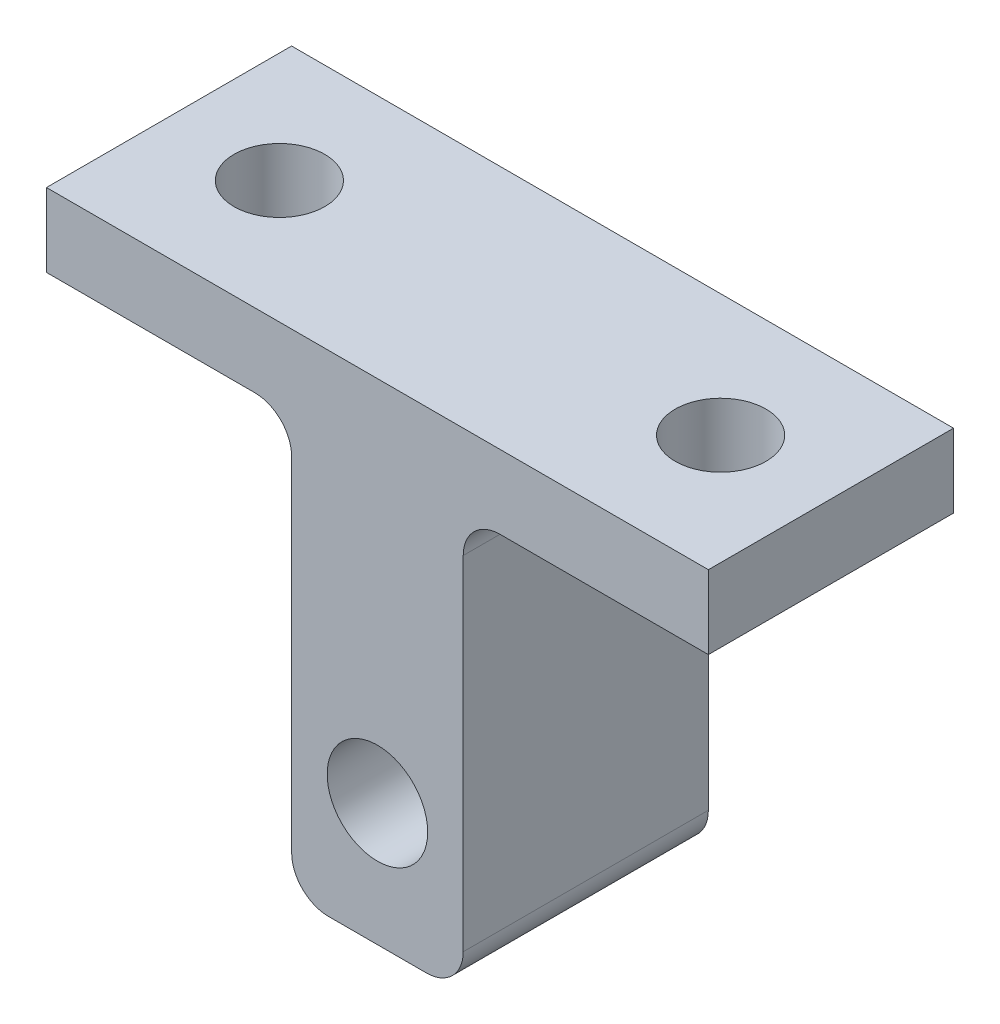
ISO-10303-21;
HEADER;
FILE_DESCRIPTION(('STEP AP214'),'2;1');
FILE_NAME('part.step','',(''),(''),'','','');
FILE_SCHEMA(('AUTOMOTIVE_DESIGN { 1 0 10303 214 1 1 1 1 }'));
ENDSEC;
DATA;
#1=APPLICATION_CONTEXT('core data for automotive mechanical design processes');
#2=APPLICATION_PROTOCOL_DEFINITION('international standard','automotive_design',2000,#1);
#3=PRODUCT_CONTEXT('',#1,'mechanical');
#4=PRODUCT('Part','Part','',(#3));
#5=PRODUCT_RELATED_PRODUCT_CATEGORY('part','',(#4));
#6=PRODUCT_DEFINITION_FORMATION('','',#4);
#7=PRODUCT_DEFINITION_CONTEXT('part definition',#1,'design');
#8=PRODUCT_DEFINITION('design','',#6,#7);
#9=PRODUCT_DEFINITION_SHAPE('','',#8);
#10=(LENGTH_UNIT() NAMED_UNIT(*) SI_UNIT(.MILLI.,.METRE.));
#11=(NAMED_UNIT(*) PLANE_ANGLE_UNIT() SI_UNIT($,.RADIAN.));
#12=(NAMED_UNIT(*) SI_UNIT($,.STERADIAN.) SOLID_ANGLE_UNIT());
#13=UNCERTAINTY_MEASURE_WITH_UNIT(LENGTH_MEASURE(1.E-05),#10,'distance_accuracy_value','');
#14=(GEOMETRIC_REPRESENTATION_CONTEXT(3) GLOBAL_UNCERTAINTY_ASSIGNED_CONTEXT((#13)) GLOBAL_UNIT_ASSIGNED_CONTEXT((#10,
#11,#12)) REPRESENTATION_CONTEXT('',''));
#15=CARTESIAN_POINT('',(0.,0.,0.));
#16=DIRECTION('',(0.,0.,1.));
#17=DIRECTION('',(1.,0.,0.));
#18=AXIS2_PLACEMENT_3D('',#15,#16,#17);
#19=CARTESIAN_POINT('',(0.,0.,5.));
#20=DIRECTION('',(0.,0.,-1.));
#21=DIRECTION('',(-1.,0.,0.));
#22=AXIS2_PLACEMENT_3D('',#19,#20,#21);
#23=PLANE('',#22);
#24=DIRECTION('',(0.,-1.,0.));
#25=VECTOR('',#24,1.);
#26=CARTESIAN_POINT('',(-3.5,0.,5.));
#27=LINE('',#26,#25);
#28=CARTESIAN_POINT('',(-3.5,-1.5,5.));
#29=VERTEX_POINT('',#28);
#30=CARTESIAN_POINT('',(-3.5,-15.5,5.));
#31=VERTEX_POINT('',#30);
#32=EDGE_CURVE('E130',#29,#31,#27,.T.);
#33=ORIENTED_EDGE('',*,*,#32,.T.);
#34=CARTESIAN_POINT('',(-2.,-15.5,5.));
#35=DIRECTION('',(0.,0.,-1.));
#36=DIRECTION('',(-1.,0.,0.));
#37=AXIS2_PLACEMENT_3D('',#34,#35,#36);
#38=CIRCLE('',#37,1.5);
#39=CARTESIAN_POINT('',(-2.,-17.,5.));
#40=VERTEX_POINT('',#39);
#41=EDGE_CURVE('E175',#31,#40,#38,.F.);
#42=ORIENTED_EDGE('',*,*,#41,.T.);
#43=DIRECTION('',(1.,0.,0.));
#44=VECTOR('',#43,1.);
#45=CARTESIAN_POINT('',(-3.5,-17.,5.));
#46=LINE('',#45,#44);
#47=CARTESIAN_POINT('',(2.,-17.,5.));
#48=VERTEX_POINT('',#47);
#49=EDGE_CURVE('E193',#40,#48,#46,.T.);
#50=ORIENTED_EDGE('',*,*,#49,.T.);
#51=CARTESIAN_POINT('',(2.,-15.5,5.));
#52=DIRECTION('',(0.,0.,-1.));
#53=DIRECTION('',(-1.,0.,0.));
#54=AXIS2_PLACEMENT_3D('',#51,#52,#53);
#55=CIRCLE('',#54,1.5);
#56=CARTESIAN_POINT('',(3.5,-15.5,5.));
#57=VERTEX_POINT('',#56);
#58=EDGE_CURVE('E173',#48,#57,#55,.F.);
#59=ORIENTED_EDGE('',*,*,#58,.T.);
#60=DIRECTION('',(0.,1.,0.));
#61=VECTOR('',#60,1.);
#62=CARTESIAN_POINT('',(3.5,-17.,5.));
#63=LINE('',#62,#61);
#64=CARTESIAN_POINT('',(3.5,-1.5,5.));
#65=VERTEX_POINT('',#64);
#66=EDGE_CURVE('E196',#57,#65,#63,.T.);
#67=ORIENTED_EDGE('',*,*,#66,.T.);
#68=CARTESIAN_POINT('',(5.,-1.5,5.));
#69=DIRECTION('',(0.,0.,-1.));
#70=DIRECTION('',(-1.,0.,0.));
#71=AXIS2_PLACEMENT_3D('',#68,#69,#70);
#72=CIRCLE('',#71,1.5);
#73=CARTESIAN_POINT('',(5.,0.,5.));
#74=VERTEX_POINT('',#73);
#75=EDGE_CURVE('E180',#65,#74,#72,.T.);
#76=ORIENTED_EDGE('',*,*,#75,.T.);
#77=DIRECTION('',(1.,0.,0.));
#78=VECTOR('',#77,1.);
#79=CARTESIAN_POINT('',(3.5,0.,5.));
#80=LINE('',#79,#78);
#81=CARTESIAN_POINT('',(13.5023923444976,0.,5.));
#82=VERTEX_POINT('',#81);
#83=EDGE_CURVE('E201',#74,#82,#80,.T.);
#84=ORIENTED_EDGE('',*,*,#83,.T.);
#85=DIRECTION('',(0.,1.,0.));
#86=VECTOR('',#85,1.);
#87=CARTESIAN_POINT('',(13.5023923444976,3.,5.));
#88=LINE('',#87,#86);
#89=CARTESIAN_POINT('',(13.5023923444976,3.,5.));
#90=VERTEX_POINT('',#89);
#91=EDGE_CURVE('E203',#82,#90,#88,.T.);
#92=ORIENTED_EDGE('',*,*,#91,.T.);
#93=DIRECTION('',(-1.,0.,0.));
#94=VECTOR('',#93,1.);
#95=CARTESIAN_POINT('',(-13.5023923444976,3.,5.));
#96=LINE('',#95,#94);
#97=CARTESIAN_POINT('',(-13.5023923444976,3.,5.));
#98=VERTEX_POINT('',#97);
#99=EDGE_CURVE('E136',#90,#98,#96,.T.);
#100=ORIENTED_EDGE('',*,*,#99,.T.);
#101=DIRECTION('',(0.,-1.,0.));
#102=VECTOR('',#101,1.);
#103=CARTESIAN_POINT('',(-13.5023923444976,0.,5.));
#104=LINE('',#103,#102);
#105=CARTESIAN_POINT('',(-13.5023923444976,0.,5.));
#106=VERTEX_POINT('',#105);
#107=EDGE_CURVE('E131',#98,#106,#104,.T.);
#108=ORIENTED_EDGE('',*,*,#107,.T.);
#109=DIRECTION('',(1.,0.,0.));
#110=VECTOR('',#109,1.);
#111=CARTESIAN_POINT('',(-13.5023923444976,0.,5.));
#112=LINE('',#111,#110);
#113=CARTESIAN_POINT('',(-5.,0.,5.));
#114=VERTEX_POINT('',#113);
#115=EDGE_CURVE('E122',#106,#114,#112,.T.);
#116=ORIENTED_EDGE('',*,*,#115,.T.);
#117=CARTESIAN_POINT('',(-5.,-1.5,5.));
#118=DIRECTION('',(0.,0.,-1.));
#119=DIRECTION('',(-1.,0.,0.));
#120=AXIS2_PLACEMENT_3D('',#117,#118,#119);
#121=CIRCLE('',#120,1.5);
#122=EDGE_CURVE('E11',#114,#29,#121,.T.);
#123=ORIENTED_EDGE('',*,*,#122,.T.);
#124=EDGE_LOOP('',(#33,#42,#50,#59,#67,#76,#84,#92,#100,#108,#116,#123));
#125=FACE_BOUND('',#124,.T.);
#126=CARTESIAN_POINT('',(0.,-12.,5.));
#127=DIRECTION('',(0.,0.,1.));
#128=DIRECTION('',(1.,0.,0.));
#129=AXIS2_PLACEMENT_3D('',#126,#127,#128);
#130=CIRCLE('',#129,2.05);
#131=CARTESIAN_POINT('',(2.05,-12.,5.));
#132=VERTEX_POINT('',#131);
#133=EDGE_CURVE('E207',#132,#132,#130,.T.);
#134=ORIENTED_EDGE('',*,*,#133,.F.);
#135=EDGE_LOOP('',(#134));
#136=FACE_BOUND('',#135,.T.);
#137=ADVANCED_FACE('F33',(#125,#136),#23,.F.);
#138=CARTESIAN_POINT('',(0.,0.,-5.));
#139=DIRECTION('',(0.,0.,-1.));
#140=DIRECTION('',(-1.,0.,0.));
#141=AXIS2_PLACEMENT_3D('',#138,#139,#140);
#142=PLANE('',#141);
#143=DIRECTION('',(1.,0.,0.));
#144=VECTOR('',#143,1.);
#145=CARTESIAN_POINT('',(-3.5,-17.,-5.));
#146=LINE('',#145,#144);
#147=CARTESIAN_POINT('',(-2.,-17.,-5.));
#148=VERTEX_POINT('',#147);
#149=CARTESIAN_POINT('',(2.,-17.,-5.));
#150=VERTEX_POINT('',#149);
#151=EDGE_CURVE('E210',#148,#150,#146,.T.);
#152=ORIENTED_EDGE('',*,*,#151,.F.);
#153=CARTESIAN_POINT('',(-2.,-15.5,-5.));
#154=DIRECTION('',(0.,0.,-1.));
#155=DIRECTION('',(-1.,0.,0.));
#156=AXIS2_PLACEMENT_3D('',#153,#154,#155);
#157=CIRCLE('',#156,1.5);
#158=CARTESIAN_POINT('',(-3.5,-15.5,-5.));
#159=VERTEX_POINT('',#158);
#160=EDGE_CURVE('E167',#148,#159,#157,.T.);
#161=ORIENTED_EDGE('',*,*,#160,.T.);
#162=DIRECTION('',(0.,-1.,0.));
#163=VECTOR('',#162,1.);
#164=CARTESIAN_POINT('',(-3.5,0.,-5.));
#165=LINE('',#164,#163);
#166=CARTESIAN_POINT('',(-3.5,-1.5,-5.));
#167=VERTEX_POINT('',#166);
#168=EDGE_CURVE('E187',#167,#159,#165,.T.);
#169=ORIENTED_EDGE('',*,*,#168,.F.);
#170=CARTESIAN_POINT('',(-5.,-1.5,-5.));
#171=DIRECTION('',(0.,0.,-1.));
#172=DIRECTION('',(-1.,0.,0.));
#173=AXIS2_PLACEMENT_3D('',#170,#171,#172);
#174=CIRCLE('',#173,1.5);
#175=CARTESIAN_POINT('',(-5.,0.,-5.));
#176=VERTEX_POINT('',#175);
#177=EDGE_CURVE('E41',#167,#176,#174,.F.);
#178=ORIENTED_EDGE('',*,*,#177,.T.);
#179=DIRECTION('',(1.,0.,0.));
#180=VECTOR('',#179,1.);
#181=CARTESIAN_POINT('',(-13.5023923444976,0.,-5.));
#182=LINE('',#181,#180);
#183=CARTESIAN_POINT('',(-13.5023923444976,0.,-5.));
#184=VERTEX_POINT('',#183);
#185=EDGE_CURVE('E186',#184,#176,#182,.T.);
#186=ORIENTED_EDGE('',*,*,#185,.F.);
#187=DIRECTION('',(0.,-1.,0.));
#188=VECTOR('',#187,1.);
#189=CARTESIAN_POINT('',(-13.5023923444976,0.,-5.));
#190=LINE('',#189,#188);
#191=CARTESIAN_POINT('',(-13.5023923444976,3.,-5.));
#192=VERTEX_POINT('',#191);
#193=EDGE_CURVE('E144',#192,#184,#190,.T.);
#194=ORIENTED_EDGE('',*,*,#193,.F.);
#195=DIRECTION('',(-1.,0.,0.));
#196=VECTOR('',#195,1.);
#197=CARTESIAN_POINT('',(-13.5023923444976,3.,-5.));
#198=LINE('',#197,#196);
#199=CARTESIAN_POINT('',(13.5023923444976,3.,-5.));
#200=VERTEX_POINT('',#199);
#201=EDGE_CURVE('E140',#200,#192,#198,.T.);
#202=ORIENTED_EDGE('',*,*,#201,.F.);
#203=DIRECTION('',(0.,1.,0.));
#204=VECTOR('',#203,1.);
#205=CARTESIAN_POINT('',(13.5023923444976,3.,-5.));
#206=LINE('',#205,#204);
#207=CARTESIAN_POINT('',(13.5023923444976,0.,-5.));
#208=VERTEX_POINT('',#207);
#209=EDGE_CURVE('E218',#208,#200,#206,.T.);
#210=ORIENTED_EDGE('',*,*,#209,.F.);
#211=DIRECTION('',(1.,0.,0.));
#212=VECTOR('',#211,1.);
#213=CARTESIAN_POINT('',(3.5,0.,-5.));
#214=LINE('',#213,#212);
#215=CARTESIAN_POINT('',(5.,0.,-5.));
#216=VERTEX_POINT('',#215);
#217=EDGE_CURVE('E216',#216,#208,#214,.T.);
#218=ORIENTED_EDGE('',*,*,#217,.F.);
#219=CARTESIAN_POINT('',(5.,-1.5,-5.));
#220=DIRECTION('',(0.,0.,-1.));
#221=DIRECTION('',(-1.,0.,0.));
#222=AXIS2_PLACEMENT_3D('',#219,#220,#221);
#223=CIRCLE('',#222,1.5);
#224=CARTESIAN_POINT('',(3.5,-1.5,-5.));
#225=VERTEX_POINT('',#224);
#226=EDGE_CURVE('E178',#216,#225,#223,.F.);
#227=ORIENTED_EDGE('',*,*,#226,.T.);
#228=DIRECTION('',(0.,1.,0.));
#229=VECTOR('',#228,1.);
#230=CARTESIAN_POINT('',(3.5,-17.,-5.));
#231=LINE('',#230,#229);
#232=CARTESIAN_POINT('',(3.5,-15.5,-5.));
#233=VERTEX_POINT('',#232);
#234=EDGE_CURVE('E213',#233,#225,#231,.T.);
#235=ORIENTED_EDGE('',*,*,#234,.F.);
#236=CARTESIAN_POINT('',(2.,-15.5,-5.));
#237=DIRECTION('',(0.,0.,-1.));
#238=DIRECTION('',(-1.,0.,0.));
#239=AXIS2_PLACEMENT_3D('',#236,#237,#238);
#240=CIRCLE('',#239,1.5);
#241=EDGE_CURVE('E165',#233,#150,#240,.T.);
#242=ORIENTED_EDGE('',*,*,#241,.T.);
#243=EDGE_LOOP('',(#152,#161,#169,#178,#186,#194,#202,#210,#218,#227,#235,#242));
#244=FACE_BOUND('',#243,.T.);
#245=CARTESIAN_POINT('',(0.,-12.,-5.));
#246=DIRECTION('',(0.,0.,1.));
#247=DIRECTION('',(1.,0.,0.));
#248=AXIS2_PLACEMENT_3D('',#245,#246,#247);
#249=CIRCLE('',#248,2.05);
#250=CARTESIAN_POINT('',(2.05,-12.,-5.));
#251=VERTEX_POINT('',#250);
#252=EDGE_CURVE('E388',#251,#251,#249,.T.);
#253=ORIENTED_EDGE('',*,*,#252,.T.);
#254=EDGE_LOOP('',(#253));
#255=FACE_BOUND('',#254,.T.);
#256=ADVANCED_FACE('F184',(#244,#255),#142,.T.);
#257=CARTESIAN_POINT('',(-13.5023923444976,0.,5.));
#258=DIRECTION('',(1.,0.,0.));
#259=DIRECTION('',(0.,0.,-1.));
#260=AXIS2_PLACEMENT_3D('',#257,#258,#259);
#261=PLANE('',#260);
#262=ORIENTED_EDGE('',*,*,#193,.T.);
#263=DIRECTION('',(0.,0.,-1.));
#264=VECTOR('',#263,1.);
#265=CARTESIAN_POINT('',(-13.5023923444976,0.,5.));
#266=LINE('',#265,#264);
#267=EDGE_CURVE('E126',#106,#184,#266,.T.);
#268=ORIENTED_EDGE('',*,*,#267,.F.);
#269=ORIENTED_EDGE('',*,*,#107,.F.);
#270=DIRECTION('',(0.,0.,-1.));
#271=VECTOR('',#270,1.);
#272=CARTESIAN_POINT('',(-13.5023923444976,3.,5.));
#273=LINE('',#272,#271);
#274=EDGE_CURVE('E206',#98,#192,#273,.T.);
#275=ORIENTED_EDGE('',*,*,#274,.T.);
#276=EDGE_LOOP('',(#262,#268,#269,#275));
#277=FACE_BOUND('',#276,.T.);
#278=ADVANCED_FACE('F142',(#277),#261,.F.);
#279=CARTESIAN_POINT('',(-13.5023923444976,0.,5.));
#280=DIRECTION('',(0.,1.,0.));
#281=DIRECTION('',(0.,0.,1.));
#282=AXIS2_PLACEMENT_3D('',#279,#280,#281);
#283=PLANE('',#282);
#284=CARTESIAN_POINT('',(-9.,0.,0.));
#285=DIRECTION('',(0.,1.,0.));
#286=DIRECTION('',(0.,0.,1.));
#287=AXIS2_PLACEMENT_3D('',#284,#285,#286);
#288=CIRCLE('',#287,1.85);
#289=CARTESIAN_POINT('',(-9.,0.,1.85));
#290=VERTEX_POINT('',#289);
#291=EDGE_CURVE('E382',#290,#290,#288,.T.);
#292=ORIENTED_EDGE('',*,*,#291,.T.);
#293=EDGE_LOOP('',(#292));
#294=FACE_BOUND('',#293,.T.);
#295=ORIENTED_EDGE('',*,*,#185,.T.);
#296=DIRECTION('',(0.,0.,-1.));
#297=VECTOR('',#296,1.);
#298=CARTESIAN_POINT('',(-5.,0.,5.));
#299=LINE('',#298,#297);
#300=EDGE_CURVE('E48',#176,#114,#299,.F.);
#301=ORIENTED_EDGE('',*,*,#300,.T.);
#302=ORIENTED_EDGE('',*,*,#115,.F.);
#303=ORIENTED_EDGE('',*,*,#267,.T.);
#304=EDGE_LOOP('',(#295,#301,#302,#303));
#305=FACE_BOUND('',#304,.T.);
#306=ADVANCED_FACE('F124',(#294,#305),#283,.F.);
#307=CARTESIAN_POINT('',(-3.5,0.,5.));
#308=DIRECTION('',(1.,0.,0.));
#309=DIRECTION('',(0.,1.,0.));
#310=AXIS2_PLACEMENT_3D('',#307,#308,#309);
#311=PLANE('',#310);
#312=ORIENTED_EDGE('',*,*,#168,.T.);
#313=DIRECTION('',(0.,0.,-1.));
#314=VECTOR('',#313,1.);
#315=CARTESIAN_POINT('',(-3.5,-15.5,5.));
#316=LINE('',#315,#314);
#317=EDGE_CURVE('E56',#159,#31,#316,.F.);
#318=ORIENTED_EDGE('',*,*,#317,.T.);
#319=ORIENTED_EDGE('',*,*,#32,.F.);
#320=DIRECTION('',(0.,0.,-1.));
#321=VECTOR('',#320,1.);
#322=CARTESIAN_POINT('',(-3.5,-1.5,-5.));
#323=LINE('',#322,#321);
#324=EDGE_CURVE('E169',#29,#167,#323,.T.);
#325=ORIENTED_EDGE('',*,*,#324,.T.);
#326=EDGE_LOOP('',(#312,#318,#319,#325));
#327=FACE_BOUND('',#326,.T.);
#328=ADVANCED_FACE('F192',(#327),#311,.F.);
#329=CARTESIAN_POINT('',(-3.5,-17.,5.));
#330=DIRECTION('',(0.,1.,0.));
#331=DIRECTION('',(0.,0.,1.));
#332=AXIS2_PLACEMENT_3D('',#329,#330,#331);
#333=PLANE('',#332);
#334=ORIENTED_EDGE('',*,*,#49,.F.);
#335=DIRECTION('',(0.,0.,-1.));
#336=VECTOR('',#335,1.);
#337=CARTESIAN_POINT('',(-2.,-17.,5.));
#338=LINE('',#337,#336);
#339=EDGE_CURVE('E162',#40,#148,#338,.T.);
#340=ORIENTED_EDGE('',*,*,#339,.T.);
#341=ORIENTED_EDGE('',*,*,#151,.T.);
#342=DIRECTION('',(0.,0.,-1.));
#343=VECTOR('',#342,1.);
#344=CARTESIAN_POINT('',(2.,-17.,5.));
#345=LINE('',#344,#343);
#346=EDGE_CURVE('E160',#150,#48,#345,.F.);
#347=ORIENTED_EDGE('',*,*,#346,.T.);
#348=EDGE_LOOP('',(#334,#340,#341,#347));
#349=FACE_BOUND('',#348,.T.);
#350=ADVANCED_FACE('F251',(#349),#333,.F.);
#351=CARTESIAN_POINT('',(3.5,-17.,5.));
#352=DIRECTION('',(-1.,0.,0.));
#353=DIRECTION('',(0.,-1.,0.));
#354=AXIS2_PLACEMENT_3D('',#351,#352,#353);
#355=PLANE('',#354);
#356=ORIENTED_EDGE('',*,*,#234,.T.);
#357=DIRECTION('',(0.,0.,-1.));
#358=VECTOR('',#357,1.);
#359=CARTESIAN_POINT('',(3.5,-1.5,5.));
#360=LINE('',#359,#358);
#361=EDGE_CURVE('E158',#225,#65,#360,.F.);
#362=ORIENTED_EDGE('',*,*,#361,.T.);
#363=ORIENTED_EDGE('',*,*,#66,.F.);
#364=DIRECTION('',(0.,0.,-1.));
#365=VECTOR('',#364,1.);
#366=CARTESIAN_POINT('',(3.5,-15.5,5.));
#367=LINE('',#366,#365);
#368=EDGE_CURVE('E149',#57,#233,#367,.T.);
#369=ORIENTED_EDGE('',*,*,#368,.T.);
#370=EDGE_LOOP('',(#356,#362,#363,#369));
#371=FACE_BOUND('',#370,.T.);
#372=ADVANCED_FACE('F242',(#371),#355,.F.);
#373=CARTESIAN_POINT('',(3.5,0.,5.));
#374=DIRECTION('',(0.,1.,0.));
#375=DIRECTION('',(0.,0.,1.));
#376=AXIS2_PLACEMENT_3D('',#373,#374,#375);
#377=PLANE('',#376);
#378=CARTESIAN_POINT('',(9.,0.,0.));
#379=DIRECTION('',(0.,1.,0.));
#380=DIRECTION('',(0.,0.,1.));
#381=AXIS2_PLACEMENT_3D('',#378,#379,#380);
#382=CIRCLE('',#381,1.85);
#383=CARTESIAN_POINT('',(9.,0.,1.85));
#384=VERTEX_POINT('',#383);
#385=EDGE_CURVE('E378',#384,#384,#382,.T.);
#386=ORIENTED_EDGE('',*,*,#385,.T.);
#387=EDGE_LOOP('',(#386));
#388=FACE_BOUND('',#387,.T.);
#389=ORIENTED_EDGE('',*,*,#83,.F.);
#390=DIRECTION('',(0.,0.,-1.));
#391=VECTOR('',#390,1.);
#392=CARTESIAN_POINT('',(5.,0.,-5.));
#393=LINE('',#392,#391);
#394=EDGE_CURVE('E145',#74,#216,#393,.T.);
#395=ORIENTED_EDGE('',*,*,#394,.T.);
#396=ORIENTED_EDGE('',*,*,#217,.T.);
#397=DIRECTION('',(0.,0.,-1.));
#398=VECTOR('',#397,1.);
#399=CARTESIAN_POINT('',(13.5023923444976,0.,5.));
#400=LINE('',#399,#398);
#401=EDGE_CURVE('E146',#82,#208,#400,.T.);
#402=ORIENTED_EDGE('',*,*,#401,.F.);
#403=EDGE_LOOP('',(#389,#395,#396,#402));
#404=FACE_BOUND('',#403,.T.);
#405=ADVANCED_FACE('F234',(#388,#404),#377,.F.);
#406=CARTESIAN_POINT('',(13.5023923444976,3.,5.));
#407=DIRECTION('',(-1.,0.,0.));
#408=DIRECTION('',(0.,0.,1.));
#409=AXIS2_PLACEMENT_3D('',#406,#407,#408);
#410=PLANE('',#409);
#411=ORIENTED_EDGE('',*,*,#209,.T.);
#412=DIRECTION('',(0.,0.,-1.));
#413=VECTOR('',#412,1.);
#414=CARTESIAN_POINT('',(13.5023923444976,3.,5.));
#415=LINE('',#414,#413);
#416=EDGE_CURVE('E152',#90,#200,#415,.T.);
#417=ORIENTED_EDGE('',*,*,#416,.F.);
#418=ORIENTED_EDGE('',*,*,#91,.F.);
#419=ORIENTED_EDGE('',*,*,#401,.T.);
#420=EDGE_LOOP('',(#411,#417,#418,#419));
#421=FACE_BOUND('',#420,.T.);
#422=ADVANCED_FACE('F230',(#421),#410,.F.);
#423=CARTESIAN_POINT('',(-13.5023923444976,3.,5.));
#424=DIRECTION('',(0.,-1.,0.));
#425=DIRECTION('',(0.,0.,-1.));
#426=AXIS2_PLACEMENT_3D('',#423,#424,#425);
#427=PLANE('',#426);
#428=CARTESIAN_POINT('',(9.,3.,0.));
#429=DIRECTION('',(0.,1.,0.));
#430=DIRECTION('',(0.,0.,1.));
#431=AXIS2_PLACEMENT_3D('',#428,#429,#430);
#432=CIRCLE('',#431,1.85);
#433=CARTESIAN_POINT('',(9.,3.,1.85));
#434=VERTEX_POINT('',#433);
#435=EDGE_CURVE('E375',#434,#434,#432,.T.);
#436=ORIENTED_EDGE('',*,*,#435,.F.);
#437=EDGE_LOOP('',(#436));
#438=FACE_BOUND('',#437,.T.);
#439=CARTESIAN_POINT('',(-9.,3.,0.));
#440=DIRECTION('',(0.,1.,0.));
#441=DIRECTION('',(0.,0.,1.));
#442=AXIS2_PLACEMENT_3D('',#439,#440,#441);
#443=CIRCLE('',#442,1.85);
#444=CARTESIAN_POINT('',(-9.,3.,1.85));
#445=VERTEX_POINT('',#444);
#446=EDGE_CURVE('E379',#445,#445,#443,.T.);
#447=ORIENTED_EDGE('',*,*,#446,.F.);
#448=EDGE_LOOP('',(#447));
#449=FACE_BOUND('',#448,.T.);
#450=ORIENTED_EDGE('',*,*,#201,.T.);
#451=ORIENTED_EDGE('',*,*,#274,.F.);
#452=ORIENTED_EDGE('',*,*,#99,.F.);
#453=ORIENTED_EDGE('',*,*,#416,.T.);
#454=EDGE_LOOP('',(#450,#451,#452,#453));
#455=FACE_BOUND('',#454,.T.);
#456=ADVANCED_FACE('F225',(#438,#449,#455),#427,.F.);
#457=CARTESIAN_POINT('',(0.,-12.,5.));
#458=DIRECTION('',(0.,0.,-1.));
#459=DIRECTION('',(-1.,0.,0.));
#460=AXIS2_PLACEMENT_3D('',#457,#458,#459);
#461=CYLINDRICAL_SURFACE('',#460,2.05);
#462=ORIENTED_EDGE('',*,*,#133,.T.);
#463=EDGE_LOOP('',(#462));
#464=FACE_BOUND('',#463,.T.);
#465=ORIENTED_EDGE('',*,*,#252,.F.);
#466=EDGE_LOOP('',(#465));
#467=FACE_BOUND('',#466,.T.);
#468=ADVANCED_FACE('F261',(#464,#467),#461,.F.);
#469=CARTESIAN_POINT('',(5.,-1.5,5.));
#470=DIRECTION('',(0.,0.,1.));
#471=DIRECTION('',(1.,0.,0.));
#472=AXIS2_PLACEMENT_3D('',#469,#470,#471);
#473=CYLINDRICAL_SURFACE('',#472,1.5);
#474=ORIENTED_EDGE('',*,*,#75,.F.);
#475=ORIENTED_EDGE('',*,*,#361,.F.);
#476=ORIENTED_EDGE('',*,*,#226,.F.);
#477=ORIENTED_EDGE('',*,*,#394,.F.);
#478=EDGE_LOOP('',(#474,#475,#476,#477));
#479=FACE_BOUND('',#478,.T.);
#480=ADVANCED_FACE('F238',(#479),#473,.F.);
#481=CARTESIAN_POINT('',(-2.,-15.5,5.));
#482=DIRECTION('',(0.,0.,-1.));
#483=DIRECTION('',(-1.,0.,0.));
#484=AXIS2_PLACEMENT_3D('',#481,#482,#483);
#485=CYLINDRICAL_SURFACE('',#484,1.5);
#486=ORIENTED_EDGE('',*,*,#41,.F.);
#487=ORIENTED_EDGE('',*,*,#317,.F.);
#488=ORIENTED_EDGE('',*,*,#160,.F.);
#489=ORIENTED_EDGE('',*,*,#339,.F.);
#490=EDGE_LOOP('',(#486,#487,#488,#489));
#491=FACE_BOUND('',#490,.T.);
#492=ADVANCED_FACE('F254',(#491),#485,.T.);
#493=CARTESIAN_POINT('',(2.,-15.5,5.));
#494=DIRECTION('',(0.,0.,-1.));
#495=DIRECTION('',(-1.,0.,0.));
#496=AXIS2_PLACEMENT_3D('',#493,#494,#495);
#497=CYLINDRICAL_SURFACE('',#496,1.5);
#498=ORIENTED_EDGE('',*,*,#58,.F.);
#499=ORIENTED_EDGE('',*,*,#346,.F.);
#500=ORIENTED_EDGE('',*,*,#241,.F.);
#501=ORIENTED_EDGE('',*,*,#368,.F.);
#502=EDGE_LOOP('',(#498,#499,#500,#501));
#503=FACE_BOUND('',#502,.T.);
#504=ADVANCED_FACE('F247',(#503),#497,.T.);
#505=CARTESIAN_POINT('',(-5.,-1.5,5.));
#506=DIRECTION('',(0.,0.,1.));
#507=DIRECTION('',(1.,0.,0.));
#508=AXIS2_PLACEMENT_3D('',#505,#506,#507);
#509=CYLINDRICAL_SURFACE('',#508,1.5);
#510=ORIENTED_EDGE('',*,*,#122,.F.);
#511=ORIENTED_EDGE('',*,*,#300,.F.);
#512=ORIENTED_EDGE('',*,*,#177,.F.);
#513=ORIENTED_EDGE('',*,*,#324,.F.);
#514=EDGE_LOOP('',(#510,#511,#512,#513));
#515=FACE_BOUND('',#514,.T.);
#516=ADVANCED_FACE('F35',(#515),#509,.F.);
#517=CARTESIAN_POINT('',(-9.,-17.,0.));
#518=DIRECTION('',(0.,1.,0.));
#519=DIRECTION('',(0.,0.,1.));
#520=AXIS2_PLACEMENT_3D('',#517,#518,#519);
#521=CYLINDRICAL_SURFACE('',#520,1.85);
#522=ORIENTED_EDGE('',*,*,#446,.T.);
#523=EDGE_LOOP('',(#522));
#524=FACE_BOUND('',#523,.T.);
#525=ORIENTED_EDGE('',*,*,#291,.F.);
#526=EDGE_LOOP('',(#525));
#527=FACE_BOUND('',#526,.T.);
#528=ADVANCED_FACE('F351',(#524,#527),#521,.F.);
#529=CARTESIAN_POINT('',(9.,-17.,0.));
#530=DIRECTION('',(0.,1.,0.));
#531=DIRECTION('',(0.,0.,1.));
#532=AXIS2_PLACEMENT_3D('',#529,#530,#531);
#533=CYLINDRICAL_SURFACE('',#532,1.85);
#534=ORIENTED_EDGE('',*,*,#435,.T.);
#535=EDGE_LOOP('',(#534));
#536=FACE_BOUND('',#535,.T.);
#537=ORIENTED_EDGE('',*,*,#385,.F.);
#538=EDGE_LOOP('',(#537));
#539=FACE_BOUND('',#538,.T.);
#540=ADVANCED_FACE('F359',(#536,#539),#533,.F.);
#541=CLOSED_SHELL('',(#137,#256,#278,#306,#328,#350,#372,#405,#422,#456,#468,#480,#492,#504,
#516,#528,#540));
#542=MANIFOLD_SOLID_BREP('B2',#541);
#543=ADVANCED_BREP_SHAPE_REPRESENTATION('',(#18,#542),#14);
#544=SHAPE_DEFINITION_REPRESENTATION(#9,#543);
ENDSEC;
END-ISO-10303-21;
